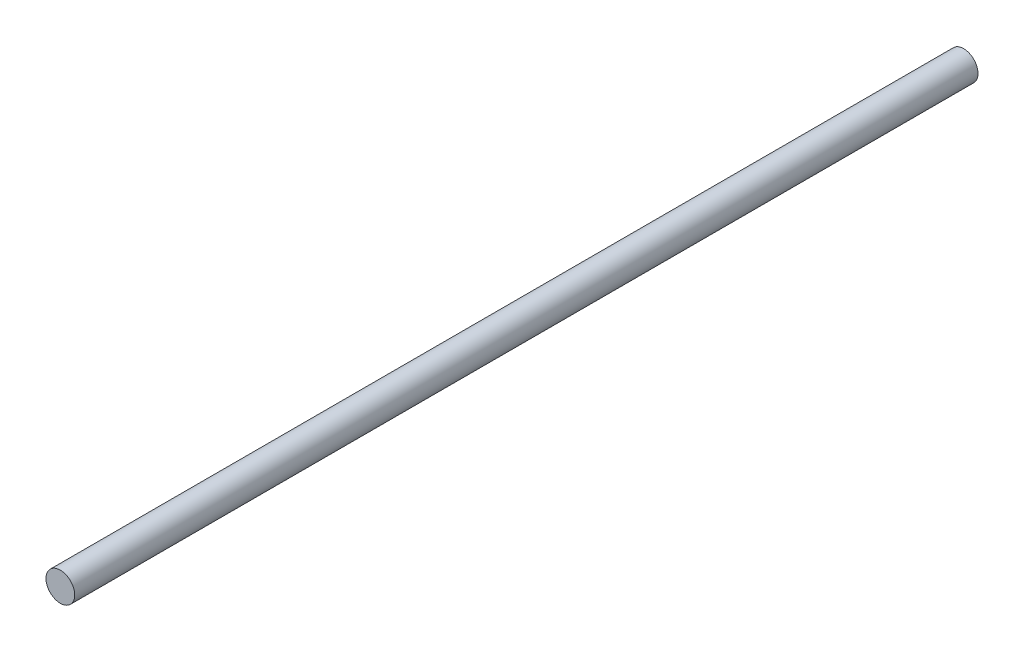
ISO-10303-21;
HEADER;
FILE_DESCRIPTION(('STEP AP214'),'2;1');
FILE_NAME('part.step','',(''),(''),'','','');
FILE_SCHEMA(('AUTOMOTIVE_DESIGN { 1 0 10303 214 1 1 1 1 }'));
ENDSEC;
DATA;
#1=APPLICATION_CONTEXT('core data for automotive mechanical design processes');
#2=APPLICATION_PROTOCOL_DEFINITION('international standard','automotive_design',2000,#1);
#3=PRODUCT_CONTEXT('',#1,'mechanical');
#4=PRODUCT('Part','Part','',(#3));
#5=PRODUCT_RELATED_PRODUCT_CATEGORY('part','',(#4));
#6=PRODUCT_DEFINITION_FORMATION('','',#4);
#7=PRODUCT_DEFINITION_CONTEXT('part definition',#1,'design');
#8=PRODUCT_DEFINITION('design','',#6,#7);
#9=PRODUCT_DEFINITION_SHAPE('','',#8);
#10=(LENGTH_UNIT() NAMED_UNIT(*) SI_UNIT(.MILLI.,.METRE.));
#11=(NAMED_UNIT(*) PLANE_ANGLE_UNIT() SI_UNIT($,.RADIAN.));
#12=(NAMED_UNIT(*) SI_UNIT($,.STERADIAN.) SOLID_ANGLE_UNIT());
#13=UNCERTAINTY_MEASURE_WITH_UNIT(LENGTH_MEASURE(1.E-05),#10,'distance_accuracy_value','');
#14=(GEOMETRIC_REPRESENTATION_CONTEXT(3) GLOBAL_UNCERTAINTY_ASSIGNED_CONTEXT((#13)) GLOBAL_UNIT_ASSIGNED_CONTEXT((#10,
#11,#12)) REPRESENTATION_CONTEXT('',''));
#15=CARTESIAN_POINT('',(0.,0.,0.));
#16=DIRECTION('',(0.,0.,1.));
#17=DIRECTION('',(1.,0.,0.));
#18=AXIS2_PLACEMENT_3D('',#15,#16,#17);
#19=CARTESIAN_POINT('',(0.,-26.5,-22.));
#20=DIRECTION('',(0.,0.,1.));
#21=DIRECTION('',(1.,0.,0.));
#22=AXIS2_PLACEMENT_3D('',#19,#20,#21);
#23=PLANE('',#22);
#24=CARTESIAN_POINT('',(0.,-26.5,-22.));
#25=DIRECTION('',(0.,0.,1.));
#26=DIRECTION('',(1.,0.,0.));
#27=AXIS2_PLACEMENT_3D('',#24,#25,#26);
#28=CIRCLE('',#27,0.35);
#29=CARTESIAN_POINT('',(0.35,-26.5,-22.));
#30=VERTEX_POINT('',#29);
#31=EDGE_CURVE('E18',#30,#30,#28,.T.);
#32=ORIENTED_EDGE('',*,*,#31,.F.);
#33=EDGE_LOOP('',(#32));
#34=FACE_BOUND('',#33,.T.);
#35=ADVANCED_FACE('F15',(#34),#23,.F.);
#36=CARTESIAN_POINT('',(0.,-26.5,0.));
#37=DIRECTION('',(0.,0.,1.));
#38=DIRECTION('',(1.,0.,0.));
#39=AXIS2_PLACEMENT_3D('',#36,#37,#38);
#40=PLANE('',#39);
#41=CARTESIAN_POINT('',(0.,-26.5,0.));
#42=DIRECTION('',(0.,0.,1.));
#43=DIRECTION('',(1.,0.,0.));
#44=AXIS2_PLACEMENT_3D('',#41,#42,#43);
#45=CIRCLE('',#44,0.35);
#46=CARTESIAN_POINT('',(0.35,-26.5,0.));
#47=VERTEX_POINT('',#46);
#48=EDGE_CURVE('E10',#47,#47,#45,.F.);
#49=ORIENTED_EDGE('',*,*,#48,.F.);
#50=EDGE_LOOP('',(#49));
#51=FACE_BOUND('',#50,.T.);
#52=ADVANCED_FACE('F30',(#51),#40,.T.);
#53=CARTESIAN_POINT('',(0.,-26.5,0.));
#54=DIRECTION('',(0.,0.,1.));
#55=DIRECTION('',(1.,0.,0.));
#56=AXIS2_PLACEMENT_3D('',#53,#54,#55);
#57=CYLINDRICAL_SURFACE('',#56,0.35);
#58=ORIENTED_EDGE('',*,*,#31,.T.);
#59=EDGE_LOOP('',(#58));
#60=FACE_BOUND('',#59,.T.);
#61=ORIENTED_EDGE('',*,*,#48,.T.);
#62=EDGE_LOOP('',(#61));
#63=FACE_BOUND('',#62,.T.);
#64=ADVANCED_FACE('F27',(#60,#63),#57,.T.);
#65=CLOSED_SHELL('',(#35,#52,#64));
#66=MANIFOLD_SOLID_BREP('B1',#65);
#67=ADVANCED_BREP_SHAPE_REPRESENTATION('',(#18,#66),#14);
#68=SHAPE_DEFINITION_REPRESENTATION(#9,#67);
ENDSEC;
END-ISO-10303-21;
